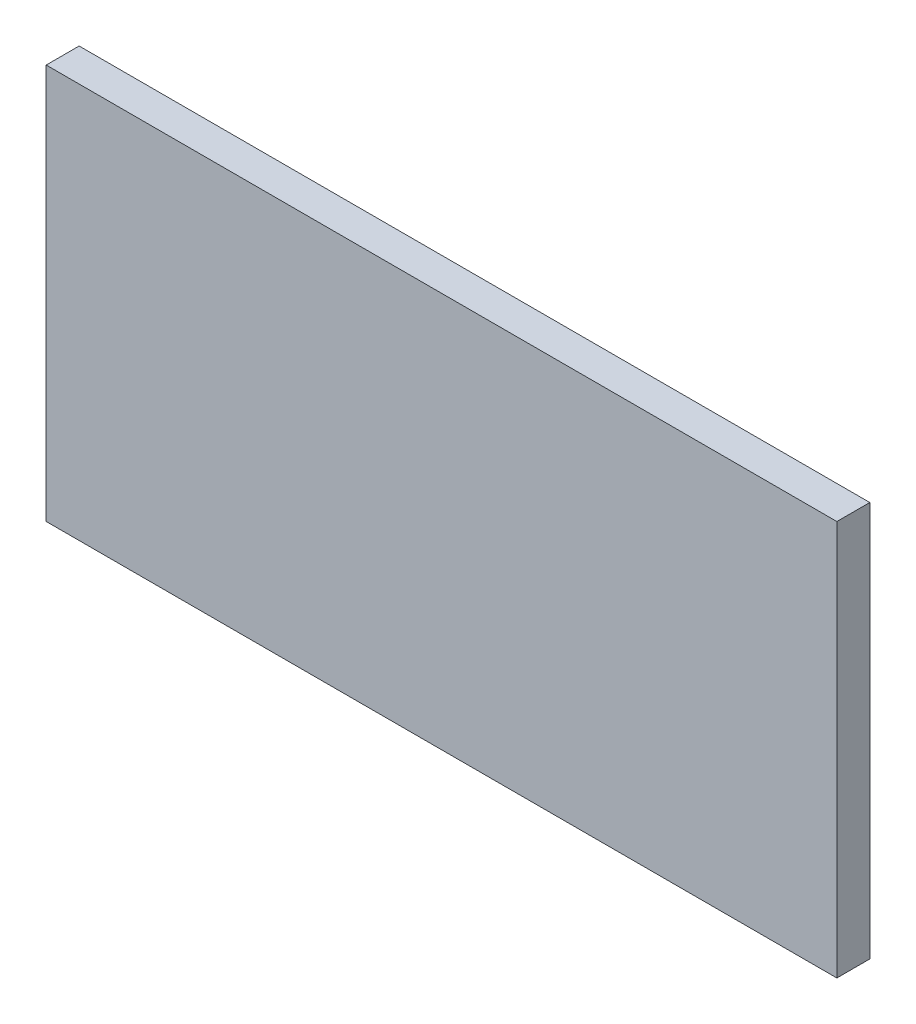
ISO-10303-21;
HEADER;
FILE_DESCRIPTION(('STEP AP214'),'2;1');
FILE_NAME('part.step','',(''),(''),'','','');
FILE_SCHEMA(('AUTOMOTIVE_DESIGN { 1 0 10303 214 1 1 1 1 }'));
ENDSEC;
DATA;
#1=APPLICATION_CONTEXT('core data for automotive mechanical design processes');
#2=APPLICATION_PROTOCOL_DEFINITION('international standard','automotive_design',2000,#1);
#3=PRODUCT_CONTEXT('',#1,'mechanical');
#4=PRODUCT('Part','Part','',(#3));
#5=PRODUCT_RELATED_PRODUCT_CATEGORY('part','',(#4));
#6=PRODUCT_DEFINITION_FORMATION('','',#4);
#7=PRODUCT_DEFINITION_CONTEXT('part definition',#1,'design');
#8=PRODUCT_DEFINITION('design','',#6,#7);
#9=PRODUCT_DEFINITION_SHAPE('','',#8);
#10=(LENGTH_UNIT() NAMED_UNIT(*) SI_UNIT(.MILLI.,.METRE.));
#11=(NAMED_UNIT(*) PLANE_ANGLE_UNIT() SI_UNIT($,.RADIAN.));
#12=(NAMED_UNIT(*) SI_UNIT($,.STERADIAN.) SOLID_ANGLE_UNIT());
#13=UNCERTAINTY_MEASURE_WITH_UNIT(LENGTH_MEASURE(1.E-05),#10,'distance_accuracy_value','');
#14=(GEOMETRIC_REPRESENTATION_CONTEXT(3) GLOBAL_UNCERTAINTY_ASSIGNED_CONTEXT((#13)) GLOBAL_UNIT_ASSIGNED_CONTEXT((#10,
#11,#12)) REPRESENTATION_CONTEXT('',''));
#15=CARTESIAN_POINT('',(0.,0.,0.));
#16=DIRECTION('',(0.,0.,1.));
#17=DIRECTION('',(1.,0.,0.));
#18=AXIS2_PLACEMENT_3D('',#15,#16,#17);
#19=CARTESIAN_POINT('',(152.4,-38.1,-3.175));
#20=DIRECTION('',(0.,0.,1.));
#21=DIRECTION('',(1.,0.,0.));
#22=AXIS2_PLACEMENT_3D('',#19,#20,#21);
#23=PLANE('',#22);
#24=DIRECTION('',(0.,1.,0.));
#25=VECTOR('',#24,1.);
#26=CARTESIAN_POINT('',(0.,-38.1,-3.175));
#27=LINE('',#26,#25);
#28=CARTESIAN_POINT('',(0.,-38.1,-3.175));
#29=VERTEX_POINT('',#28);
#30=CARTESIAN_POINT('',(0.,38.1,-3.175));
#31=VERTEX_POINT('',#30);
#32=EDGE_CURVE('E98',#29,#31,#27,.T.);
#33=ORIENTED_EDGE('',*,*,#32,.T.);
#34=DIRECTION('',(-1.,0.,0.));
#35=VECTOR('',#34,1.);
#36=CARTESIAN_POINT('',(152.4,38.1,-3.175));
#37=LINE('',#36,#35);
#38=CARTESIAN_POINT('',(152.4,38.1,-3.175));
#39=VERTEX_POINT('',#38);
#40=EDGE_CURVE('E11',#39,#31,#37,.T.);
#41=ORIENTED_EDGE('',*,*,#40,.F.);
#42=DIRECTION('',(0.,1.,0.));
#43=VECTOR('',#42,1.);
#44=CARTESIAN_POINT('',(152.4,-38.1,-3.175));
#45=LINE('',#44,#43);
#46=CARTESIAN_POINT('',(152.4,-38.1,-3.175));
#47=VERTEX_POINT('',#46);
#48=EDGE_CURVE('E86',#47,#39,#45,.T.);
#49=ORIENTED_EDGE('',*,*,#48,.F.);
#50=DIRECTION('',(-1.,0.,0.));
#51=VECTOR('',#50,1.);
#52=CARTESIAN_POINT('',(152.4,-38.1,-3.175));
#53=LINE('',#52,#51);
#54=EDGE_CURVE('E94',#47,#29,#53,.T.);
#55=ORIENTED_EDGE('',*,*,#54,.T.);
#56=EDGE_LOOP('',(#33,#41,#49,#55));
#57=FACE_BOUND('',#56,.T.);
#58=ADVANCED_FACE('F35',(#57),#23,.F.);
#59=CARTESIAN_POINT('',(152.4,38.1,3.175));
#60=DIRECTION('',(0.,-1.,0.));
#61=DIRECTION('',(0.,0.,-1.));
#62=AXIS2_PLACEMENT_3D('',#59,#60,#61);
#63=PLANE('',#62);
#64=DIRECTION('',(0.,0.,1.));
#65=VECTOR('',#64,1.);
#66=CARTESIAN_POINT('',(0.,38.1,3.175));
#67=LINE('',#66,#65);
#68=CARTESIAN_POINT('',(0.,38.1,3.175));
#69=VERTEX_POINT('',#68);
#70=EDGE_CURVE('E90',#31,#69,#67,.T.);
#71=ORIENTED_EDGE('',*,*,#70,.T.);
#72=DIRECTION('',(-1.,0.,0.));
#73=VECTOR('',#72,1.);
#74=CARTESIAN_POINT('',(152.4,38.1,3.175));
#75=LINE('',#74,#73);
#76=CARTESIAN_POINT('',(152.4,38.1,3.175));
#77=VERTEX_POINT('',#76);
#78=EDGE_CURVE('E43',#77,#69,#75,.T.);
#79=ORIENTED_EDGE('',*,*,#78,.F.);
#80=DIRECTION('',(0.,0.,1.));
#81=VECTOR('',#80,1.);
#82=CARTESIAN_POINT('',(152.4,38.1,3.175));
#83=LINE('',#82,#81);
#84=EDGE_CURVE('E81',#39,#77,#83,.T.);
#85=ORIENTED_EDGE('',*,*,#84,.F.);
#86=ORIENTED_EDGE('',*,*,#40,.T.);
#87=EDGE_LOOP('',(#71,#79,#85,#86));
#88=FACE_BOUND('',#87,.T.);
#89=ADVANCED_FACE('F89',(#88),#63,.F.);
#90=CARTESIAN_POINT('',(152.4,-38.1,3.175));
#91=DIRECTION('',(0.,0.,-1.));
#92=DIRECTION('',(-1.,0.,0.));
#93=AXIS2_PLACEMENT_3D('',#90,#91,#92);
#94=PLANE('',#93);
#95=DIRECTION('',(0.,-1.,0.));
#96=VECTOR('',#95,1.);
#97=CARTESIAN_POINT('',(0.,-38.1,3.175));
#98=LINE('',#97,#96);
#99=CARTESIAN_POINT('',(0.,-38.1,3.175));
#100=VERTEX_POINT('',#99);
#101=EDGE_CURVE('E68',#69,#100,#98,.T.);
#102=ORIENTED_EDGE('',*,*,#101,.T.);
#103=DIRECTION('',(-1.,0.,0.));
#104=VECTOR('',#103,1.);
#105=CARTESIAN_POINT('',(152.4,-38.1,3.175));
#106=LINE('',#105,#104);
#107=CARTESIAN_POINT('',(152.4,-38.1,3.175));
#108=VERTEX_POINT('',#107);
#109=EDGE_CURVE('E91',#108,#100,#106,.T.);
#110=ORIENTED_EDGE('',*,*,#109,.F.);
#111=DIRECTION('',(0.,-1.,0.));
#112=VECTOR('',#111,1.);
#113=CARTESIAN_POINT('',(152.4,-38.1,3.175));
#114=LINE('',#113,#112);
#115=EDGE_CURVE('E84',#77,#108,#114,.T.);
#116=ORIENTED_EDGE('',*,*,#115,.F.);
#117=ORIENTED_EDGE('',*,*,#78,.T.);
#118=EDGE_LOOP('',(#102,#110,#116,#117));
#119=FACE_BOUND('',#118,.T.);
#120=ADVANCED_FACE('F92',(#119),#94,.F.);
#121=CARTESIAN_POINT('',(152.4,-38.1,3.175));
#122=DIRECTION('',(0.,1.,0.));
#123=DIRECTION('',(0.,0.,1.));
#124=AXIS2_PLACEMENT_3D('',#121,#122,#123);
#125=PLANE('',#124);
#126=DIRECTION('',(0.,0.,-1.));
#127=VECTOR('',#126,1.);
#128=CARTESIAN_POINT('',(0.,-38.1,3.175));
#129=LINE('',#128,#127);
#130=EDGE_CURVE('E74',#100,#29,#129,.T.);
#131=ORIENTED_EDGE('',*,*,#130,.T.);
#132=ORIENTED_EDGE('',*,*,#54,.F.);
#133=DIRECTION('',(0.,0.,-1.));
#134=VECTOR('',#133,1.);
#135=CARTESIAN_POINT('',(152.4,-38.1,3.175));
#136=LINE('',#135,#134);
#137=EDGE_CURVE('E51',#108,#47,#136,.T.);
#138=ORIENTED_EDGE('',*,*,#137,.F.);
#139=ORIENTED_EDGE('',*,*,#109,.T.);
#140=EDGE_LOOP('',(#131,#132,#138,#139));
#141=FACE_BOUND('',#140,.T.);
#142=ADVANCED_FACE('F105',(#141),#125,.F.);
#143=CARTESIAN_POINT('',(152.4,0.,0.));
#144=DIRECTION('',(-1.,0.,0.));
#145=DIRECTION('',(0.,0.,1.));
#146=AXIS2_PLACEMENT_3D('',#143,#144,#145);
#147=PLANE('',#146);
#148=ORIENTED_EDGE('',*,*,#48,.T.);
#149=ORIENTED_EDGE('',*,*,#84,.T.);
#150=ORIENTED_EDGE('',*,*,#115,.T.);
#151=ORIENTED_EDGE('',*,*,#137,.T.);
#152=EDGE_LOOP('',(#148,#149,#150,#151));
#153=FACE_BOUND('',#152,.T.);
#154=ADVANCED_FACE('F82',(#153),#147,.F.);
#155=CARTESIAN_POINT('',(0.,0.,0.));
#156=DIRECTION('',(-1.,0.,0.));
#157=DIRECTION('',(0.,0.,1.));
#158=AXIS2_PLACEMENT_3D('',#155,#156,#157);
#159=PLANE('',#158);
#160=ORIENTED_EDGE('',*,*,#32,.F.);
#161=ORIENTED_EDGE('',*,*,#130,.F.);
#162=ORIENTED_EDGE('',*,*,#101,.F.);
#163=ORIENTED_EDGE('',*,*,#70,.F.);
#164=EDGE_LOOP('',(#160,#161,#162,#163));
#165=FACE_BOUND('',#164,.T.);
#166=ADVANCED_FACE('F108',(#165),#159,.T.);
#167=CLOSED_SHELL('',(#58,#89,#120,#142,#154,#166));
#168=MANIFOLD_SOLID_BREP('B2',#167);
#169=ADVANCED_BREP_SHAPE_REPRESENTATION('',(#18,#168),#14);
#170=SHAPE_DEFINITION_REPRESENTATION(#9,#169);
ENDSEC;
END-ISO-10303-21;
